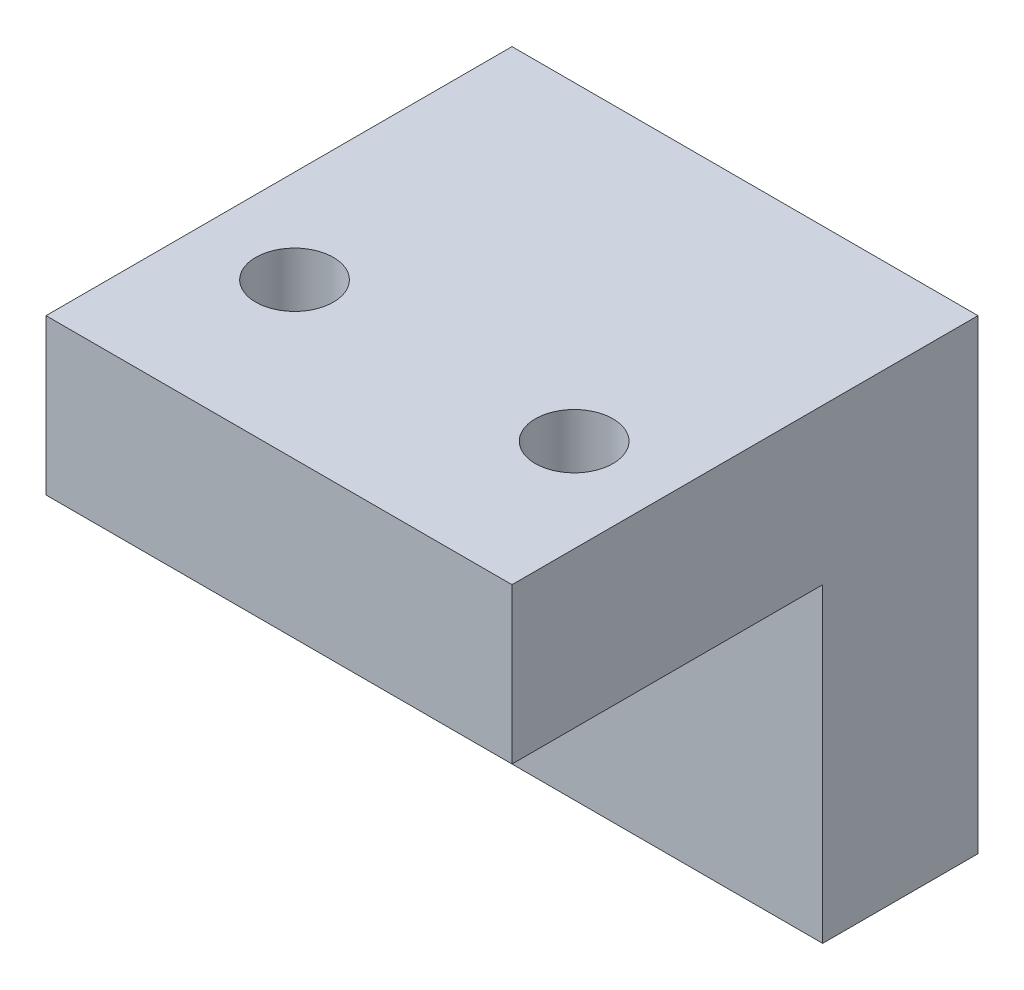
ISO-10303-21;
HEADER;
FILE_DESCRIPTION(('STEP AP214'),'2;1');
FILE_NAME('part.step','',(''),(''),'','','');
FILE_SCHEMA(('AUTOMOTIVE_DESIGN { 1 0 10303 214 1 1 1 1 }'));
ENDSEC;
DATA;
#1=APPLICATION_CONTEXT('core data for automotive mechanical design processes');
#2=APPLICATION_PROTOCOL_DEFINITION('international standard','automotive_design',2000,#1);
#3=PRODUCT_CONTEXT('',#1,'mechanical');
#4=PRODUCT('Part','Part','',(#3));
#5=PRODUCT_RELATED_PRODUCT_CATEGORY('part','',(#4));
#6=PRODUCT_DEFINITION_FORMATION('','',#4);
#7=PRODUCT_DEFINITION_CONTEXT('part definition',#1,'design');
#8=PRODUCT_DEFINITION('design','',#6,#7);
#9=PRODUCT_DEFINITION_SHAPE('','',#8);
#10=(LENGTH_UNIT() NAMED_UNIT(*) SI_UNIT(.MILLI.,.METRE.));
#11=(NAMED_UNIT(*) PLANE_ANGLE_UNIT() SI_UNIT($,.RADIAN.));
#12=(NAMED_UNIT(*) SI_UNIT($,.STERADIAN.) SOLID_ANGLE_UNIT());
#13=UNCERTAINTY_MEASURE_WITH_UNIT(LENGTH_MEASURE(1.E-05),#10,'distance_accuracy_value','');
#14=(GEOMETRIC_REPRESENTATION_CONTEXT(3) GLOBAL_UNCERTAINTY_ASSIGNED_CONTEXT((#13)) GLOBAL_UNIT_ASSIGNED_CONTEXT((#10,
#11,#12)) REPRESENTATION_CONTEXT('',''));
#15=CARTESIAN_POINT('',(0.,0.,0.));
#16=DIRECTION('',(0.,0.,1.));
#17=DIRECTION('',(1.,0.,0.));
#18=AXIS2_PLACEMENT_3D('',#15,#16,#17);
#19=CARTESIAN_POINT('',(0.,10.,0.));
#20=DIRECTION('',(1.,0.,0.));
#21=DIRECTION('',(0.,0.,-1.));
#22=AXIS2_PLACEMENT_3D('',#19,#20,#21);
#23=PLANE('',#22);
#24=DIRECTION('',(0.,0.,1.));
#25=VECTOR('',#24,1.);
#26=CARTESIAN_POINT('',(0.,0.,0.));
#27=LINE('',#26,#25);
#28=CARTESIAN_POINT('',(0.,0.,-5.));
#29=VERTEX_POINT('',#28);
#30=CARTESIAN_POINT('',(0.,0.,0.));
#31=VERTEX_POINT('',#30);
#32=EDGE_CURVE('E96',#29,#31,#27,.T.);
#33=ORIENTED_EDGE('',*,*,#32,.T.);
#34=DIRECTION('',(0.,-1.,0.));
#35=VECTOR('',#34,1.);
#36=CARTESIAN_POINT('',(0.,10.,0.));
#37=LINE('',#36,#35);
#38=CARTESIAN_POINT('',(0.,10.,0.));
#39=VERTEX_POINT('',#38);
#40=EDGE_CURVE('E12',#39,#31,#37,.T.);
#41=ORIENTED_EDGE('',*,*,#40,.F.);
#42=DIRECTION('',(0.,0.,1.));
#43=VECTOR('',#42,1.);
#44=CARTESIAN_POINT('',(0.,10.,-5.));
#45=LINE('',#44,#43);
#46=CARTESIAN_POINT('',(0.,10.,10.));
#47=VERTEX_POINT('',#46);
#48=EDGE_CURVE('E121',#39,#47,#45,.T.);
#49=ORIENTED_EDGE('',*,*,#48,.T.);
#50=DIRECTION('',(0.,-1.,0.));
#51=VECTOR('',#50,1.);
#52=CARTESIAN_POINT('',(0.,15.,10.));
#53=LINE('',#52,#51);
#54=CARTESIAN_POINT('',(0.,15.,10.));
#55=VERTEX_POINT('',#54);
#56=EDGE_CURVE('E115',#55,#47,#53,.T.);
#57=ORIENTED_EDGE('',*,*,#56,.F.);
#58=DIRECTION('',(0.,0.,1.));
#59=VECTOR('',#58,1.);
#60=CARTESIAN_POINT('',(0.,15.,-5.));
#61=LINE('',#60,#59);
#62=CARTESIAN_POINT('',(0.,15.,-5.));
#63=VERTEX_POINT('',#62);
#64=EDGE_CURVE('E105',#63,#55,#61,.T.);
#65=ORIENTED_EDGE('',*,*,#64,.F.);
#66=DIRECTION('',(0.,-1.,0.));
#67=VECTOR('',#66,1.);
#68=CARTESIAN_POINT('',(0.,10.,-5.));
#69=LINE('',#68,#67);
#70=EDGE_CURVE('E91',#63,#29,#69,.T.);
#71=ORIENTED_EDGE('',*,*,#70,.T.);
#72=EDGE_LOOP('',(#33,#41,#49,#57,#65,#71));
#73=FACE_BOUND('',#72,.T.);
#74=ADVANCED_FACE('F39',(#73),#23,.F.);
#75=CARTESIAN_POINT('',(0.,10.,0.));
#76=DIRECTION('',(0.,0.,-1.));
#77=DIRECTION('',(-1.,0.,0.));
#78=AXIS2_PLACEMENT_3D('',#75,#76,#77);
#79=PLANE('',#78);
#80=CARTESIAN_POINT('',(7.5,5.,0.));
#81=DIRECTION('',(0.,0.,1.));
#82=DIRECTION('',(1.,0.,0.));
#83=AXIS2_PLACEMENT_3D('',#80,#81,#82);
#84=CIRCLE('',#83,1.25);
#85=CARTESIAN_POINT('',(8.75,5.,0.));
#86=VERTEX_POINT('',#85);
#87=EDGE_CURVE('E153',#86,#86,#84,.T.);
#88=ORIENTED_EDGE('',*,*,#87,.F.);
#89=EDGE_LOOP('',(#88));
#90=FACE_BOUND('',#89,.T.);
#91=DIRECTION('',(1.,0.,0.));
#92=VECTOR('',#91,1.);
#93=CARTESIAN_POINT('',(0.,0.,0.));
#94=LINE('',#93,#92);
#95=CARTESIAN_POINT('',(15.,0.,0.));
#96=VERTEX_POINT('',#95);
#97=EDGE_CURVE('E82',#31,#96,#94,.T.);
#98=ORIENTED_EDGE('',*,*,#97,.T.);
#99=DIRECTION('',(0.,-1.,0.));
#100=VECTOR('',#99,1.);
#101=CARTESIAN_POINT('',(15.,10.,0.));
#102=LINE('',#101,#100);
#103=CARTESIAN_POINT('',(15.,10.,0.));
#104=VERTEX_POINT('',#103);
#105=EDGE_CURVE('E47',#104,#96,#102,.T.);
#106=ORIENTED_EDGE('',*,*,#105,.F.);
#107=DIRECTION('',(1.,0.,0.));
#108=VECTOR('',#107,1.);
#109=CARTESIAN_POINT('',(0.,10.,0.));
#110=LINE('',#109,#108);
#111=EDGE_CURVE('E53',#39,#104,#110,.T.);
#112=ORIENTED_EDGE('',*,*,#111,.F.);
#113=ORIENTED_EDGE('',*,*,#40,.T.);
#114=EDGE_LOOP('',(#98,#106,#112,#113));
#115=FACE_BOUND('',#114,.T.);
#116=ADVANCED_FACE('F134',(#90,#115),#79,.F.);
#117=CARTESIAN_POINT('',(15.,10.,0.));
#118=DIRECTION('',(-1.,0.,0.));
#119=DIRECTION('',(0.,0.,1.));
#120=AXIS2_PLACEMENT_3D('',#117,#118,#119);
#121=PLANE('',#120);
#122=DIRECTION('',(0.,0.,-1.));
#123=VECTOR('',#122,1.);
#124=CARTESIAN_POINT('',(15.,0.,0.));
#125=LINE('',#124,#123);
#126=CARTESIAN_POINT('',(15.,0.,-5.));
#127=VERTEX_POINT('',#126);
#128=EDGE_CURVE('E71',#96,#127,#125,.T.);
#129=ORIENTED_EDGE('',*,*,#128,.T.);
#130=DIRECTION('',(0.,-1.,0.));
#131=VECTOR('',#130,1.);
#132=CARTESIAN_POINT('',(15.,10.,-5.));
#133=LINE('',#132,#131);
#134=CARTESIAN_POINT('',(15.,15.,-5.));
#135=VERTEX_POINT('',#134);
#136=EDGE_CURVE('E76',#135,#127,#133,.T.);
#137=ORIENTED_EDGE('',*,*,#136,.F.);
#138=DIRECTION('',(0.,0.,-1.));
#139=VECTOR('',#138,1.);
#140=CARTESIAN_POINT('',(15.,15.,-5.));
#141=LINE('',#140,#139);
#142=CARTESIAN_POINT('',(15.,15.,10.));
#143=VERTEX_POINT('',#142);
#144=EDGE_CURVE('E111',#143,#135,#141,.T.);
#145=ORIENTED_EDGE('',*,*,#144,.F.);
#146=DIRECTION('',(0.,-1.,0.));
#147=VECTOR('',#146,1.);
#148=CARTESIAN_POINT('',(15.,15.,10.));
#149=LINE('',#148,#147);
#150=CARTESIAN_POINT('',(15.,10.,10.));
#151=VERTEX_POINT('',#150);
#152=EDGE_CURVE('E112',#143,#151,#149,.T.);
#153=ORIENTED_EDGE('',*,*,#152,.T.);
#154=DIRECTION('',(0.,0.,-1.));
#155=VECTOR('',#154,1.);
#156=CARTESIAN_POINT('',(15.,10.,-5.));
#157=LINE('',#156,#155);
#158=EDGE_CURVE('E128',#151,#104,#157,.T.);
#159=ORIENTED_EDGE('',*,*,#158,.T.);
#160=ORIENTED_EDGE('',*,*,#105,.T.);
#161=EDGE_LOOP('',(#129,#137,#145,#153,#159,#160));
#162=FACE_BOUND('',#161,.T.);
#163=ADVANCED_FACE('F73',(#162),#121,.F.);
#164=CARTESIAN_POINT('',(0.,10.,-5.));
#165=DIRECTION('',(0.,0.,1.));
#166=DIRECTION('',(1.,0.,0.));
#167=AXIS2_PLACEMENT_3D('',#164,#165,#166);
#168=PLANE('',#167);
#169=CARTESIAN_POINT('',(7.5,5.,-5.));
#170=DIRECTION('',(0.,0.,1.));
#171=DIRECTION('',(1.,0.,0.));
#172=AXIS2_PLACEMENT_3D('',#169,#170,#171);
#173=CIRCLE('',#172,1.25);
#174=CARTESIAN_POINT('',(8.75,5.,-5.));
#175=VERTEX_POINT('',#174);
#176=EDGE_CURVE('E125',#175,#175,#173,.T.);
#177=ORIENTED_EDGE('',*,*,#176,.T.);
#178=EDGE_LOOP('',(#177));
#179=FACE_BOUND('',#178,.T.);
#180=DIRECTION('',(-1.,0.,0.));
#181=VECTOR('',#180,1.);
#182=CARTESIAN_POINT('',(0.,0.,-5.));
#183=LINE('',#182,#181);
#184=EDGE_CURVE('E81',#127,#29,#183,.T.);
#185=ORIENTED_EDGE('',*,*,#184,.T.);
#186=ORIENTED_EDGE('',*,*,#70,.F.);
#187=DIRECTION('',(-1.,0.,0.));
#188=VECTOR('',#187,1.);
#189=CARTESIAN_POINT('',(0.,15.,-5.));
#190=LINE('',#189,#188);
#191=EDGE_CURVE('E90',#135,#63,#190,.T.);
#192=ORIENTED_EDGE('',*,*,#191,.F.);
#193=ORIENTED_EDGE('',*,*,#136,.T.);
#194=EDGE_LOOP('',(#185,#186,#192,#193));
#195=FACE_BOUND('',#194,.T.);
#196=ADVANCED_FACE('F86',(#179,#195),#168,.F.);
#197=CARTESIAN_POINT('',(0.,0.,0.));
#198=DIRECTION('',(0.,-1.,0.));
#199=DIRECTION('',(0.,0.,-1.));
#200=AXIS2_PLACEMENT_3D('',#197,#198,#199);
#201=PLANE('',#200);
#202=ORIENTED_EDGE('',*,*,#32,.F.);
#203=ORIENTED_EDGE('',*,*,#184,.F.);
#204=ORIENTED_EDGE('',*,*,#128,.F.);
#205=ORIENTED_EDGE('',*,*,#97,.F.);
#206=EDGE_LOOP('',(#202,#203,#204,#205));
#207=FACE_BOUND('',#206,.T.);
#208=ADVANCED_FACE('F94',(#207),#201,.T.);
#209=CARTESIAN_POINT('',(0.,10.,0.));
#210=DIRECTION('',(0.,1.,0.));
#211=DIRECTION('',(0.,0.,1.));
#212=AXIS2_PLACEMENT_3D('',#209,#210,#211);
#213=PLANE('',#212);
#214=CARTESIAN_POINT('',(3.,10.,5.));
#215=DIRECTION('',(0.,1.,0.));
#216=DIRECTION('',(0.,0.,1.));
#217=AXIS2_PLACEMENT_3D('',#214,#215,#216);
#218=CIRCLE('',#217,1.25);
#219=CARTESIAN_POINT('',(3.,10.,6.25));
#220=VERTEX_POINT('',#219);
#221=EDGE_CURVE('E156',#220,#220,#218,.T.);
#222=ORIENTED_EDGE('',*,*,#221,.T.);
#223=EDGE_LOOP('',(#222));
#224=FACE_BOUND('',#223,.T.);
#225=CARTESIAN_POINT('',(12.,10.,5.));
#226=DIRECTION('',(0.,1.,0.));
#227=DIRECTION('',(0.,0.,1.));
#228=AXIS2_PLACEMENT_3D('',#225,#226,#227);
#229=CIRCLE('',#228,1.25);
#230=CARTESIAN_POINT('',(12.,10.,6.25));
#231=VERTEX_POINT('',#230);
#232=EDGE_CURVE('E162',#231,#231,#229,.T.);
#233=ORIENTED_EDGE('',*,*,#232,.T.);
#234=EDGE_LOOP('',(#233));
#235=FACE_BOUND('',#234,.T.);
#236=ORIENTED_EDGE('',*,*,#48,.F.);
#237=ORIENTED_EDGE('',*,*,#111,.T.);
#238=ORIENTED_EDGE('',*,*,#158,.F.);
#239=DIRECTION('',(1.,0.,0.));
#240=VECTOR('',#239,1.);
#241=CARTESIAN_POINT('',(0.,10.,10.));
#242=LINE('',#241,#240);
#243=EDGE_CURVE('E124',#47,#151,#242,.T.);
#244=ORIENTED_EDGE('',*,*,#243,.F.);
#245=EDGE_LOOP('',(#236,#237,#238,#244));
#246=FACE_BOUND('',#245,.T.);
#247=ADVANCED_FACE('F139',(#224,#235,#246),#213,.F.);
#248=CARTESIAN_POINT('',(0.,15.,10.));
#249=DIRECTION('',(0.,0.,-1.));
#250=DIRECTION('',(-1.,0.,0.));
#251=AXIS2_PLACEMENT_3D('',#248,#249,#250);
#252=PLANE('',#251);
#253=ORIENTED_EDGE('',*,*,#243,.T.);
#254=ORIENTED_EDGE('',*,*,#152,.F.);
#255=DIRECTION('',(1.,0.,0.));
#256=VECTOR('',#255,1.);
#257=CARTESIAN_POINT('',(0.,15.,10.));
#258=LINE('',#257,#256);
#259=EDGE_CURVE('E117',#55,#143,#258,.T.);
#260=ORIENTED_EDGE('',*,*,#259,.F.);
#261=ORIENTED_EDGE('',*,*,#56,.T.);
#262=EDGE_LOOP('',(#253,#254,#260,#261));
#263=FACE_BOUND('',#262,.T.);
#264=ADVANCED_FACE('F146',(#263),#252,.F.);
#265=CARTESIAN_POINT('',(0.,15.,0.));
#266=DIRECTION('',(0.,1.,0.));
#267=DIRECTION('',(0.,0.,1.));
#268=AXIS2_PLACEMENT_3D('',#265,#266,#267);
#269=PLANE('',#268);
#270=CARTESIAN_POINT('',(3.,15.,5.));
#271=DIRECTION('',(0.,1.,0.));
#272=DIRECTION('',(0.,0.,1.));
#273=AXIS2_PLACEMENT_3D('',#270,#271,#272);
#274=CIRCLE('',#273,1.25);
#275=CARTESIAN_POINT('',(3.,15.,6.25));
#276=VERTEX_POINT('',#275);
#277=EDGE_CURVE('E165',#276,#276,#274,.T.);
#278=ORIENTED_EDGE('',*,*,#277,.F.);
#279=EDGE_LOOP('',(#278));
#280=FACE_BOUND('',#279,.T.);
#281=CARTESIAN_POINT('',(12.,15.,5.));
#282=DIRECTION('',(0.,1.,0.));
#283=DIRECTION('',(0.,0.,1.));
#284=AXIS2_PLACEMENT_3D('',#281,#282,#283);
#285=CIRCLE('',#284,1.25);
#286=CARTESIAN_POINT('',(12.,15.,6.25));
#287=VERTEX_POINT('',#286);
#288=EDGE_CURVE('E159',#287,#287,#285,.T.);
#289=ORIENTED_EDGE('',*,*,#288,.F.);
#290=EDGE_LOOP('',(#289));
#291=FACE_BOUND('',#290,.T.);
#292=ORIENTED_EDGE('',*,*,#64,.T.);
#293=ORIENTED_EDGE('',*,*,#259,.T.);
#294=ORIENTED_EDGE('',*,*,#144,.T.);
#295=ORIENTED_EDGE('',*,*,#191,.T.);
#296=EDGE_LOOP('',(#292,#293,#294,#295));
#297=FACE_BOUND('',#296,.T.);
#298=ADVANCED_FACE('F108',(#280,#291,#297),#269,.T.);
#299=CARTESIAN_POINT('',(7.5,5.,-5.));
#300=DIRECTION('',(0.,0.,1.));
#301=DIRECTION('',(1.,0.,0.));
#302=AXIS2_PLACEMENT_3D('',#299,#300,#301);
#303=CYLINDRICAL_SURFACE('',#302,1.25);
#304=ORIENTED_EDGE('',*,*,#176,.F.);
#305=EDGE_LOOP('',(#304));
#306=FACE_BOUND('',#305,.T.);
#307=ORIENTED_EDGE('',*,*,#87,.T.);
#308=EDGE_LOOP('',(#307));
#309=FACE_BOUND('',#308,.T.);
#310=ADVANCED_FACE('F182',(#306,#309),#303,.F.);
#311=CARTESIAN_POINT('',(12.,10.,5.));
#312=DIRECTION('',(0.,1.,0.));
#313=DIRECTION('',(0.,0.,1.));
#314=AXIS2_PLACEMENT_3D('',#311,#312,#313);
#315=CYLINDRICAL_SURFACE('',#314,1.25);
#316=ORIENTED_EDGE('',*,*,#232,.F.);
#317=EDGE_LOOP('',(#316));
#318=FACE_BOUND('',#317,.T.);
#319=ORIENTED_EDGE('',*,*,#288,.T.);
#320=EDGE_LOOP('',(#319));
#321=FACE_BOUND('',#320,.T.);
#322=ADVANCED_FACE('F176',(#318,#321),#315,.F.);
#323=CARTESIAN_POINT('',(3.,10.,5.));
#324=DIRECTION('',(0.,1.,0.));
#325=DIRECTION('',(0.,0.,1.));
#326=AXIS2_PLACEMENT_3D('',#323,#324,#325);
#327=CYLINDRICAL_SURFACE('',#326,1.25);
#328=ORIENTED_EDGE('',*,*,#221,.F.);
#329=EDGE_LOOP('',(#328));
#330=FACE_BOUND('',#329,.T.);
#331=ORIENTED_EDGE('',*,*,#277,.T.);
#332=EDGE_LOOP('',(#331));
#333=FACE_BOUND('',#332,.T.);
#334=ADVANCED_FACE('F173',(#330,#333),#327,.F.);
#335=CLOSED_SHELL('',(#74,#116,#163,#196,#208,#247,#264,#298,#310,#322,#334));
#336=MANIFOLD_SOLID_BREP('B2',#335);
#337=ADVANCED_BREP_SHAPE_REPRESENTATION('',(#18,#336),#14);
#338=SHAPE_DEFINITION_REPRESENTATION(#9,#337);
ENDSEC;
END-ISO-10303-21;
